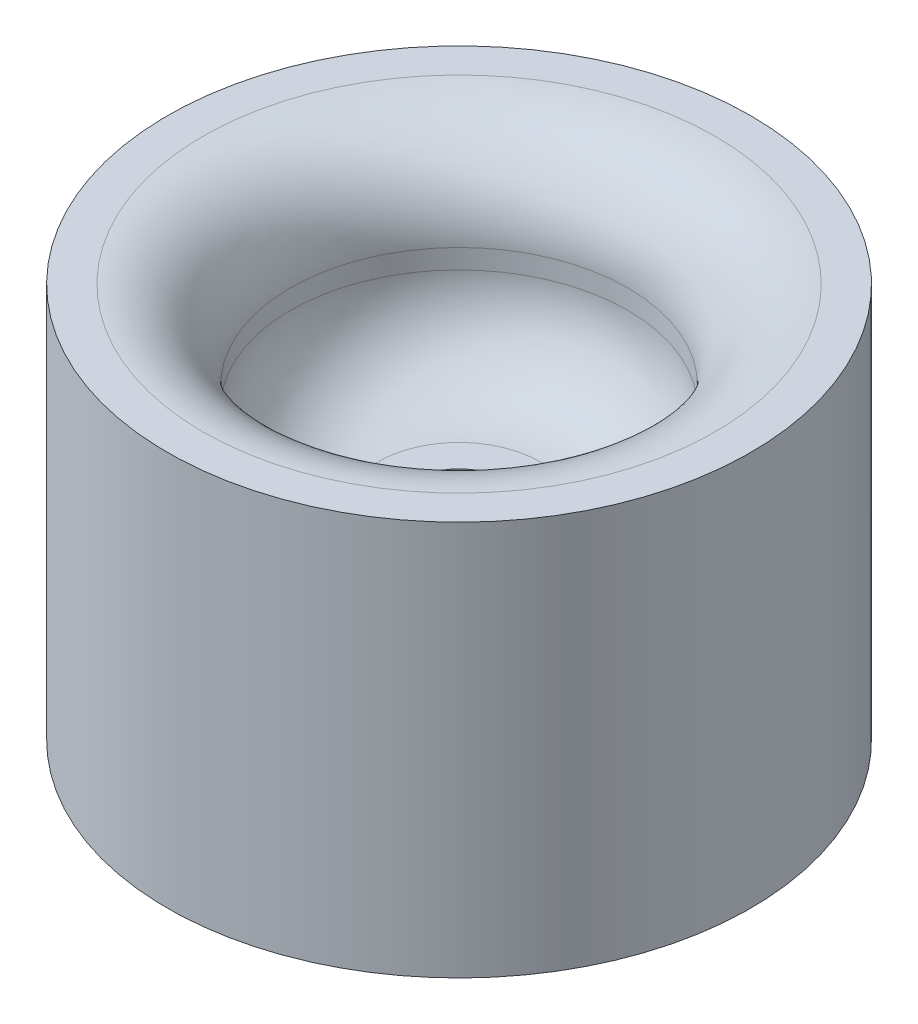
ISO-10303-21;
HEADER;
FILE_DESCRIPTION(('STEP AP214'),'2;1');
FILE_NAME('part.step','',(''),(''),'','','');
FILE_SCHEMA(('AUTOMOTIVE_DESIGN { 1 0 10303 214 1 1 1 1 }'));
ENDSEC;
DATA;
#1=APPLICATION_CONTEXT('core data for automotive mechanical design processes');
#2=APPLICATION_PROTOCOL_DEFINITION('international standard','automotive_design',2000,#1);
#3=PRODUCT_CONTEXT('',#1,'mechanical');
#4=PRODUCT('Part','Part','',(#3));
#5=PRODUCT_RELATED_PRODUCT_CATEGORY('part','',(#4));
#6=PRODUCT_DEFINITION_FORMATION('','',#4);
#7=PRODUCT_DEFINITION_CONTEXT('part definition',#1,'design');
#8=PRODUCT_DEFINITION('design','',#6,#7);
#9=PRODUCT_DEFINITION_SHAPE('','',#8);
#10=(LENGTH_UNIT() NAMED_UNIT(*) SI_UNIT(.MILLI.,.METRE.));
#11=(NAMED_UNIT(*) PLANE_ANGLE_UNIT() SI_UNIT($,.RADIAN.));
#12=(NAMED_UNIT(*) SI_UNIT($,.STERADIAN.) SOLID_ANGLE_UNIT());
#13=UNCERTAINTY_MEASURE_WITH_UNIT(LENGTH_MEASURE(1.E-05),#10,'distance_accuracy_value','');
#14=(GEOMETRIC_REPRESENTATION_CONTEXT(3) GLOBAL_UNCERTAINTY_ASSIGNED_CONTEXT((#13)) GLOBAL_UNIT_ASSIGNED_CONTEXT((#10,
#11,#12)) REPRESENTATION_CONTEXT('',''));
#15=CARTESIAN_POINT('',(0.,0.,0.));
#16=DIRECTION('',(0.,0.,1.));
#17=DIRECTION('',(1.,0.,0.));
#18=AXIS2_PLACEMENT_3D('',#15,#16,#17);
#19=CARTESIAN_POINT('',(0.,0.,0.));
#20=DIRECTION('',(0.,-1.,0.));
#21=DIRECTION('',(0.,0.,-1.));
#22=AXIS2_PLACEMENT_3D('',#19,#20,#21);
#23=CYLINDRICAL_SURFACE('',#22,76.2);
#24=CARTESIAN_POINT('',(0.,127.,0.));
#25=DIRECTION('',(0.,-1.,0.));
#26=DIRECTION('',(0.,0.,-1.));
#27=AXIS2_PLACEMENT_3D('',#24,#25,#26);
#28=CIRCLE('',#27,76.2);
#29=CARTESIAN_POINT('',(0.,127.,-76.2));
#30=VERTEX_POINT('',#29);
#31=EDGE_CURVE('E10',#30,#30,#28,.T.);
#32=ORIENTED_EDGE('',*,*,#31,.T.);
#33=EDGE_LOOP('',(#32));
#34=FACE_BOUND('',#33,.T.);
#35=CARTESIAN_POINT('',(0.,23.876,0.));
#36=DIRECTION('',(0.,-1.,0.));
#37=DIRECTION('',(0.,0.,-1.));
#38=AXIS2_PLACEMENT_3D('',#35,#36,#37);
#39=CIRCLE('',#38,76.2);
#40=CARTESIAN_POINT('',(0.,23.876,-76.2));
#41=VERTEX_POINT('',#40);
#42=EDGE_CURVE('E56',#41,#41,#39,.T.);
#43=ORIENTED_EDGE('',*,*,#42,.F.);
#44=EDGE_LOOP('',(#43));
#45=FACE_BOUND('',#44,.T.);
#46=ADVANCED_FACE('F31',(#34,#45),#23,.T.);
#47=CARTESIAN_POINT('',(0.,0.,0.));
#48=DIRECTION('',(0.,1.,0.));
#49=DIRECTION('',(0.,0.,1.));
#50=AXIS2_PLACEMENT_3D('',#47,#48,#49);
#51=CYLINDRICAL_SURFACE('',#50,12.7);
#52=CARTESIAN_POINT('',(0.,76.2,0.));
#53=DIRECTION('',(0.,1.,0.));
#54=DIRECTION('',(0.,0.,1.));
#55=AXIS2_PLACEMENT_3D('',#52,#53,#54);
#56=CIRCLE('',#55,12.7);
#57=CARTESIAN_POINT('',(0.,76.2,12.7));
#58=VERTEX_POINT('',#57);
#59=EDGE_CURVE('E53',#58,#58,#56,.T.);
#60=ORIENTED_EDGE('',*,*,#59,.T.);
#61=EDGE_LOOP('',(#60));
#62=FACE_BOUND('',#61,.T.);
#63=CARTESIAN_POINT('',(0.,23.876,0.));
#64=DIRECTION('',(0.,-1.,0.));
#65=DIRECTION('',(0.,0.,-1.));
#66=AXIS2_PLACEMENT_3D('',#63,#64,#65);
#67=CIRCLE('',#66,12.7);
#68=CARTESIAN_POINT('',(0.,23.876,-12.7));
#69=VERTEX_POINT('',#68);
#70=EDGE_CURVE('E34',#69,#69,#67,.F.);
#71=ORIENTED_EDGE('',*,*,#70,.F.);
#72=EDGE_LOOP('',(#71));
#73=FACE_BOUND('',#72,.T.);
#74=ADVANCED_FACE('F65',(#62,#73),#51,.F.);
#75=CARTESIAN_POINT('',(0.,127.,66.9008125139605));
#76=DIRECTION('',(0.,-1.,0.));
#77=DIRECTION('',(0.,0.,-1.));
#78=AXIS2_PLACEMENT_3D('',#75,#76,#77);
#79=PLANE('',#78);
#80=ORIENTED_EDGE('',*,*,#31,.F.);
#81=EDGE_LOOP('',(#80));
#82=FACE_BOUND('',#81,.T.);
#83=CARTESIAN_POINT('',(0.,127.,0.));
#84=DIRECTION('',(0.,-1.,0.));
#85=DIRECTION('',(0.,0.,-1.));
#86=AXIS2_PLACEMENT_3D('',#83,#84,#85);
#87=CIRCLE('',#86,66.9008125139605);
#88=CARTESIAN_POINT('',(0.,127.,-66.9008125139605));
#89=VERTEX_POINT('',#88);
#90=EDGE_CURVE('E38',#89,#89,#87,.T.);
#91=ORIENTED_EDGE('',*,*,#90,.T.);
#92=EDGE_LOOP('',(#91));
#93=FACE_BOUND('',#92,.T.);
#94=ADVANCED_FACE('F67',(#82,#93),#79,.F.);
#95=CARTESIAN_POINT('',(0.,104.14,0.));
#96=DIRECTION('',(0.,-1.,0.));
#97=DIRECTION('',(0.,0.,-1.));
#98=AXIS2_PLACEMENT_3D('',#95,#96,#97);
#99=TOROIDAL_SURFACE('',#98,66.9008125139603,22.86);
#100=ORIENTED_EDGE('',*,*,#90,.F.);
#101=EDGE_LOOP('',(#100));
#102=FACE_BOUND('',#101,.T.);
#103=CARTESIAN_POINT('',(0.,104.14,0.));
#104=DIRECTION('',(0.,-1.,0.));
#105=DIRECTION('',(0.,0.,-1.));
#106=AXIS2_PLACEMENT_3D('',#103,#104,#105);
#107=CIRCLE('',#106,44.0408125139603);
#108=CARTESIAN_POINT('',(0.,104.14,-44.0408125139603));
#109=VERTEX_POINT('',#108);
#110=EDGE_CURVE('E42',#109,#109,#107,.T.);
#111=ORIENTED_EDGE('',*,*,#110,.T.);
#112=EDGE_LOOP('',(#111));
#113=FACE_BOUND('',#112,.T.);
#114=ADVANCED_FACE('F74',(#102,#113),#99,.T.);
#115=CARTESIAN_POINT('',(0.,0.,0.));
#116=DIRECTION('',(0.,-1.,0.));
#117=DIRECTION('',(0.,0.,-1.));
#118=AXIS2_PLACEMENT_3D('',#115,#116,#117);
#119=CYLINDRICAL_SURFACE('',#118,44.0408125139603);
#120=ORIENTED_EDGE('',*,*,#110,.F.);
#121=EDGE_LOOP('',(#120));
#122=FACE_BOUND('',#121,.T.);
#123=CARTESIAN_POINT('',(0.,99.0600000000002,0.));
#124=DIRECTION('',(0.,-1.,0.));
#125=DIRECTION('',(0.,0.,-1.));
#126=AXIS2_PLACEMENT_3D('',#123,#124,#125);
#127=CIRCLE('',#126,44.0408125139603);
#128=CARTESIAN_POINT('',(0.,99.0600000000002,-44.0408125139603));
#129=VERTEX_POINT('',#128);
#130=EDGE_CURVE('E47',#129,#129,#127,.T.);
#131=ORIENTED_EDGE('',*,*,#130,.T.);
#132=EDGE_LOOP('',(#131));
#133=FACE_BOUND('',#132,.T.);
#134=ADVANCED_FACE('F85',(#122,#133),#119,.F.);
#135=CARTESIAN_POINT('',(0.,99.06,0.));
#136=DIRECTION('',(0.,-1.,0.));
#137=DIRECTION('',(0.,0.,-1.));
#138=AXIS2_PLACEMENT_3D('',#135,#136,#137);
#139=DEGENERATE_TOROIDAL_SURFACE('',#138,21.1808125139603,22.86,.T.);
#140=ORIENTED_EDGE('',*,*,#130,.F.);
#141=EDGE_LOOP('',(#140));
#142=FACE_BOUND('',#141,.T.);
#143=CARTESIAN_POINT('',(0.,76.2,0.));
#144=DIRECTION('',(0.,-1.,0.));
#145=DIRECTION('',(0.,0.,-1.));
#146=AXIS2_PLACEMENT_3D('',#143,#144,#145);
#147=CIRCLE('',#146,21.1808125139601);
#148=CARTESIAN_POINT('',(0.,76.2,-21.1808125139601));
#149=VERTEX_POINT('',#148);
#150=EDGE_CURVE('E50',#149,#149,#147,.T.);
#151=ORIENTED_EDGE('',*,*,#150,.T.);
#152=EDGE_LOOP('',(#151));
#153=FACE_BOUND('',#152,.T.);
#154=ADVANCED_FACE('F81',(#142,#153),#139,.F.);
#155=CARTESIAN_POINT('',(0.,76.2,0.));
#156=DIRECTION('',(0.,-1.,0.));
#157=DIRECTION('',(0.,0.,-1.));
#158=AXIS2_PLACEMENT_3D('',#155,#156,#157);
#159=PLANE('',#158);
#160=ORIENTED_EDGE('',*,*,#59,.F.);
#161=EDGE_LOOP('',(#160));
#162=FACE_BOUND('',#161,.T.);
#163=ORIENTED_EDGE('',*,*,#150,.F.);
#164=EDGE_LOOP('',(#163));
#165=FACE_BOUND('',#164,.T.);
#166=ADVANCED_FACE('F78',(#162,#165),#159,.F.);
#167=CARTESIAN_POINT('',(0.,23.876,0.));
#168=DIRECTION('',(0.,-1.,0.));
#169=DIRECTION('',(0.,0.,-1.));
#170=AXIS2_PLACEMENT_3D('',#167,#168,#169);
#171=PLANE('',#170);
#172=ORIENTED_EDGE('',*,*,#42,.T.);
#173=EDGE_LOOP('',(#172));
#174=FACE_BOUND('',#173,.T.);
#175=ORIENTED_EDGE('',*,*,#70,.T.);
#176=EDGE_LOOP('',(#175));
#177=FACE_BOUND('',#176,.T.);
#178=ADVANCED_FACE('F63',(#174,#177),#171,.T.);
#179=CLOSED_SHELL('',(#46,#74,#94,#114,#134,#154,#166,#178));
#180=MANIFOLD_SOLID_BREP('B2',#179);
#181=ADVANCED_BREP_SHAPE_REPRESENTATION('',(#18,#180),#14);
#182=SHAPE_DEFINITION_REPRESENTATION(#9,#181);
ENDSEC;
END-ISO-10303-21;
